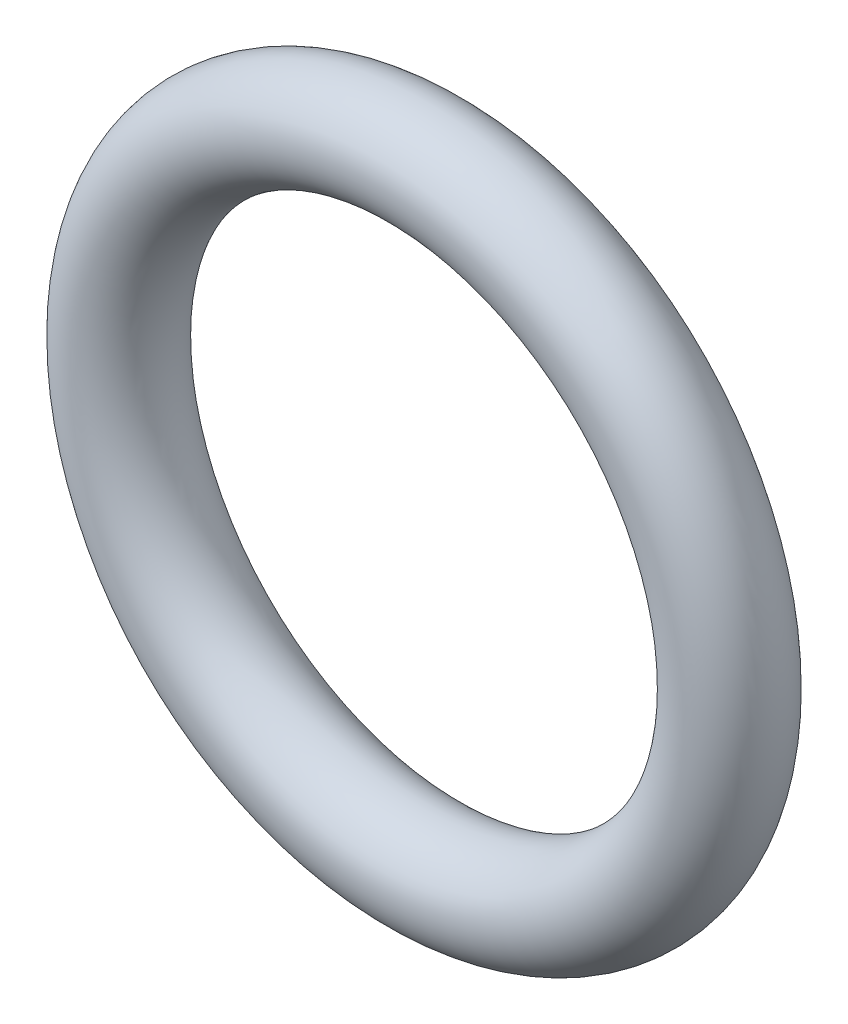
ISO-10303-21;
HEADER;
FILE_DESCRIPTION(('STEP AP214'),'2;1');
FILE_NAME('part.step','',(''),(''),'','','');
FILE_SCHEMA(('AUTOMOTIVE_DESIGN { 1 0 10303 214 1 1 1 1 }'));
ENDSEC;
DATA;
#1=APPLICATION_CONTEXT('core data for automotive mechanical design processes');
#2=APPLICATION_PROTOCOL_DEFINITION('international standard','automotive_design',2000,#1);
#3=PRODUCT_CONTEXT('',#1,'mechanical');
#4=PRODUCT('Part','Part','',(#3));
#5=PRODUCT_RELATED_PRODUCT_CATEGORY('part','',(#4));
#6=PRODUCT_DEFINITION_FORMATION('','',#4);
#7=PRODUCT_DEFINITION_CONTEXT('part definition',#1,'design');
#8=PRODUCT_DEFINITION('design','',#6,#7);
#9=PRODUCT_DEFINITION_SHAPE('','',#8);
#10=(LENGTH_UNIT() NAMED_UNIT(*) SI_UNIT(.MILLI.,.METRE.));
#11=(NAMED_UNIT(*) PLANE_ANGLE_UNIT() SI_UNIT($,.RADIAN.));
#12=(NAMED_UNIT(*) SI_UNIT($,.STERADIAN.) SOLID_ANGLE_UNIT());
#13=UNCERTAINTY_MEASURE_WITH_UNIT(LENGTH_MEASURE(1.E-05),#10,'distance_accuracy_value','');
#14=(GEOMETRIC_REPRESENTATION_CONTEXT(3) GLOBAL_UNCERTAINTY_ASSIGNED_CONTEXT((#13)) GLOBAL_UNIT_ASSIGNED_CONTEXT((#10,
#11,#12)) REPRESENTATION_CONTEXT('',''));
#15=CARTESIAN_POINT('',(0.,0.,0.));
#16=DIRECTION('',(0.,0.,1.));
#17=DIRECTION('',(1.,0.,0.));
#18=AXIS2_PLACEMENT_3D('',#15,#16,#17);
#19=CARTESIAN_POINT('',(0.,0.,0.));
#20=DIRECTION('',(0.,0.,1.));
#21=DIRECTION('',(1.,0.,0.));
#22=AXIS2_PLACEMENT_3D('',#19,#20,#21);
#23=TOROIDAL_SURFACE('',#22,6.,1.);
#24=CARTESIAN_POINT('',(7.,0.,0.));
#25=VERTEX_POINT('',#24);
#26=VERTEX_LOOP('',#25);
#27=FACE_BOUND('',#26,.T.);
#28=ADVANCED_FACE('F28',(#27),#23,.T.);
#29=CLOSED_SHELL('',(#28));
#30=MANIFOLD_SOLID_BREP('B2',#29);
#31=ADVANCED_BREP_SHAPE_REPRESENTATION('',(#18,#30),#14);
#32=SHAPE_DEFINITION_REPRESENTATION(#9,#31);
ENDSEC;
END-ISO-10303-21;
